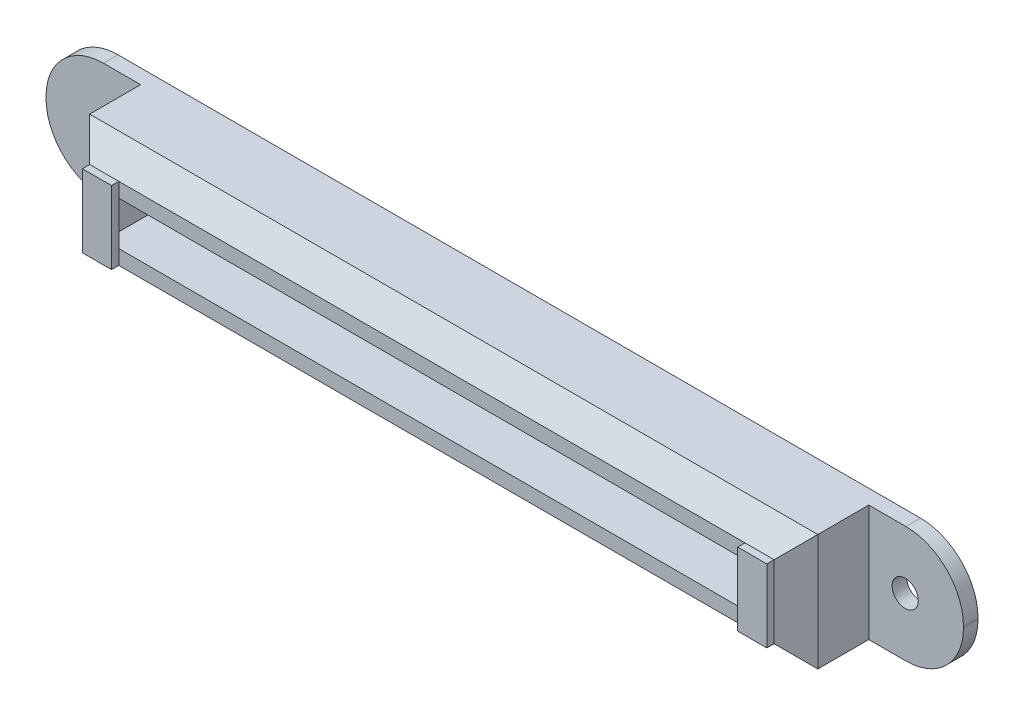
ISO-10303-21;
HEADER;
FILE_DESCRIPTION(('STEP AP214'),'2;1');
FILE_NAME('part.step','',(''),(''),'','','');
FILE_SCHEMA(('AUTOMOTIVE_DESIGN { 1 0 10303 214 1 1 1 1 }'));
ENDSEC;
DATA;
#1=APPLICATION_CONTEXT('core data for automotive mechanical design processes');
#2=APPLICATION_PROTOCOL_DEFINITION('international standard','automotive_design',2000,#1);
#3=PRODUCT_CONTEXT('',#1,'mechanical');
#4=PRODUCT('Part','Part','',(#3));
#5=PRODUCT_RELATED_PRODUCT_CATEGORY('part','',(#4));
#6=PRODUCT_DEFINITION_FORMATION('','',#4);
#7=PRODUCT_DEFINITION_CONTEXT('part definition',#1,'design');
#8=PRODUCT_DEFINITION('design','',#6,#7);
#9=PRODUCT_DEFINITION_SHAPE('','',#8);
#10=(LENGTH_UNIT() NAMED_UNIT(*) SI_UNIT(.MILLI.,.METRE.));
#11=(NAMED_UNIT(*) PLANE_ANGLE_UNIT() SI_UNIT($,.RADIAN.));
#12=(NAMED_UNIT(*) SI_UNIT($,.STERADIAN.) SOLID_ANGLE_UNIT());
#13=UNCERTAINTY_MEASURE_WITH_UNIT(LENGTH_MEASURE(1.E-05),#10,'distance_accuracy_value','');
#14=(GEOMETRIC_REPRESENTATION_CONTEXT(3) GLOBAL_UNCERTAINTY_ASSIGNED_CONTEXT((#13)) GLOBAL_UNIT_ASSIGNED_CONTEXT((#10,
#11,#12)) REPRESENTATION_CONTEXT('',''));
#15=CARTESIAN_POINT('',(0.,0.,0.));
#16=DIRECTION('',(0.,0.,1.));
#17=DIRECTION('',(1.,0.,0.));
#18=AXIS2_PLACEMENT_3D('',#15,#16,#17);
#19=CARTESIAN_POINT('',(-5.,8.,2.));
#20=DIRECTION('',(0.,0.,1.));
#21=DIRECTION('',(1.,0.,0.));
#22=AXIS2_PLACEMENT_3D('',#19,#20,#21);
#23=CYLINDRICAL_SURFACE('',#22,1.8);
#24=CARTESIAN_POINT('',(-5.,8.,0.));
#25=DIRECTION('',(0.,0.,1.));
#26=DIRECTION('',(1.,0.,0.));
#27=AXIS2_PLACEMENT_3D('',#24,#25,#26);
#28=CIRCLE('',#27,1.8);
#29=CARTESIAN_POINT('',(-3.2,8.,0.));
#30=VERTEX_POINT('',#29);
#31=EDGE_CURVE('E258',#30,#30,#28,.F.);
#32=ORIENTED_EDGE('',*,*,#31,.T.);
#33=EDGE_LOOP('',(#32));
#34=FACE_BOUND('',#33,.T.);
#35=CARTESIAN_POINT('',(-5.,8.,2.));
#36=DIRECTION('',(0.,0.,1.));
#37=DIRECTION('',(1.,0.,0.));
#38=AXIS2_PLACEMENT_3D('',#35,#36,#37);
#39=CIRCLE('',#38,1.8);
#40=CARTESIAN_POINT('',(-3.2,8.,2.));
#41=VERTEX_POINT('',#40);
#42=EDGE_CURVE('E226',#41,#41,#39,.F.);
#43=ORIENTED_EDGE('',*,*,#42,.F.);
#44=EDGE_LOOP('',(#43));
#45=FACE_BOUND('',#44,.T.);
#46=ADVANCED_FACE('F16',(#34,#45),#23,.F.);
#47=CARTESIAN_POINT('',(-13.,0.,0.));
#48=DIRECTION('',(-1.,0.,0.));
#49=DIRECTION('',(0.,0.,1.));
#50=AXIS2_PLACEMENT_3D('',#47,#48,#49);
#51=PLANE('',#50);
#52=DIRECTION('',(0.,1.,0.));
#53=VECTOR('',#52,1.);
#54=CARTESIAN_POINT('',(-13.,0.,2.));
#55=LINE('',#54,#53);
#56=CARTESIAN_POINT('',(-13.,7.9,2.));
#57=VERTEX_POINT('',#56);
#58=CARTESIAN_POINT('',(-13.,8.1,2.));
#59=VERTEX_POINT('',#58);
#60=EDGE_CURVE('E223',#57,#59,#55,.T.);
#61=ORIENTED_EDGE('',*,*,#60,.T.);
#62=DIRECTION('',(0.,0.,1.));
#63=VECTOR('',#62,1.);
#64=CARTESIAN_POINT('',(-13.,8.1,0.));
#65=LINE('',#64,#63);
#66=CARTESIAN_POINT('',(-13.,8.1,0.));
#67=VERTEX_POINT('',#66);
#68=EDGE_CURVE('E205',#67,#59,#65,.T.);
#69=ORIENTED_EDGE('',*,*,#68,.F.);
#70=DIRECTION('',(0.,1.,0.));
#71=VECTOR('',#70,1.);
#72=CARTESIAN_POINT('',(-13.,0.,0.));
#73=LINE('',#72,#71);
#74=CARTESIAN_POINT('',(-13.,7.9,0.));
#75=VERTEX_POINT('',#74);
#76=EDGE_CURVE('E227',#67,#75,#73,.F.);
#77=ORIENTED_EDGE('',*,*,#76,.T.);
#78=DIRECTION('',(0.,0.,1.));
#79=VECTOR('',#78,1.);
#80=CARTESIAN_POINT('',(-13.,7.9,0.));
#81=LINE('',#80,#79);
#82=EDGE_CURVE('E382',#57,#75,#81,.F.);
#83=ORIENTED_EDGE('',*,*,#82,.F.);
#84=EDGE_LOOP('',(#61,#69,#77,#83));
#85=FACE_BOUND('',#84,.T.);
#86=ADVANCED_FACE('F545',(#85),#51,.T.);
#87=CARTESIAN_POINT('',(113.,0.,0.));
#88=DIRECTION('',(-1.,0.,0.));
#89=DIRECTION('',(0.,0.,1.));
#90=AXIS2_PLACEMENT_3D('',#87,#88,#89);
#91=PLANE('',#90);
#92=DIRECTION('',(0.,1.,0.));
#93=VECTOR('',#92,1.);
#94=CARTESIAN_POINT('',(113.,0.,2.));
#95=LINE('',#94,#93);
#96=CARTESIAN_POINT('',(113.,8.1,2.));
#97=VERTEX_POINT('',#96);
#98=CARTESIAN_POINT('',(113.,7.9,2.));
#99=VERTEX_POINT('',#98);
#100=EDGE_CURVE('E373',#97,#99,#95,.F.);
#101=ORIENTED_EDGE('',*,*,#100,.T.);
#102=DIRECTION('',(0.,0.,1.));
#103=VECTOR('',#102,1.);
#104=CARTESIAN_POINT('',(113.,7.9,0.));
#105=LINE('',#104,#103);
#106=CARTESIAN_POINT('',(113.,7.9,0.));
#107=VERTEX_POINT('',#106);
#108=EDGE_CURVE('E250',#107,#99,#105,.T.);
#109=ORIENTED_EDGE('',*,*,#108,.F.);
#110=DIRECTION('',(0.,1.,0.));
#111=VECTOR('',#110,1.);
#112=CARTESIAN_POINT('',(113.,0.,0.));
#113=LINE('',#112,#111);
#114=CARTESIAN_POINT('',(113.,8.1,0.));
#115=VERTEX_POINT('',#114);
#116=EDGE_CURVE('E221',#115,#107,#113,.F.);
#117=ORIENTED_EDGE('',*,*,#116,.F.);
#118=DIRECTION('',(0.,0.,1.));
#119=VECTOR('',#118,1.);
#120=CARTESIAN_POINT('',(113.,8.1,0.));
#121=LINE('',#120,#119);
#122=EDGE_CURVE('E254',#97,#115,#121,.F.);
#123=ORIENTED_EDGE('',*,*,#122,.F.);
#124=EDGE_LOOP('',(#101,#109,#117,#123));
#125=FACE_BOUND('',#124,.T.);
#126=ADVANCED_FACE('F540',(#125),#91,.F.);
#127=CARTESIAN_POINT('',(105.,8.,2.));
#128=DIRECTION('',(0.,0.,1.));
#129=DIRECTION('',(1.,0.,0.));
#130=AXIS2_PLACEMENT_3D('',#127,#128,#129);
#131=CYLINDRICAL_SURFACE('',#130,1.8);
#132=CARTESIAN_POINT('',(105.,8.,2.));
#133=DIRECTION('',(0.,0.,1.));
#134=DIRECTION('',(1.,0.,0.));
#135=AXIS2_PLACEMENT_3D('',#132,#133,#134);
#136=CIRCLE('',#135,1.8);
#137=CARTESIAN_POINT('',(106.8,8.,2.));
#138=VERTEX_POINT('',#137);
#139=EDGE_CURVE('E261',#138,#138,#136,.F.);
#140=ORIENTED_EDGE('',*,*,#139,.F.);
#141=EDGE_LOOP('',(#140));
#142=FACE_BOUND('',#141,.T.);
#143=CARTESIAN_POINT('',(105.,8.,0.));
#144=DIRECTION('',(0.,0.,1.));
#145=DIRECTION('',(1.,0.,0.));
#146=AXIS2_PLACEMENT_3D('',#143,#144,#145);
#147=CIRCLE('',#146,1.8);
#148=CARTESIAN_POINT('',(106.8,8.,0.));
#149=VERTEX_POINT('',#148);
#150=EDGE_CURVE('E243',#149,#149,#147,.T.);
#151=ORIENTED_EDGE('',*,*,#150,.F.);
#152=EDGE_LOOP('',(#151));
#153=FACE_BOUND('',#152,.T.);
#154=ADVANCED_FACE('F558',(#142,#153),#131,.F.);
#155=CARTESIAN_POINT('',(-5.1,8.1,0.));
#156=DIRECTION('',(0.,0.,1.));
#157=DIRECTION('',(1.,0.,0.));
#158=AXIS2_PLACEMENT_3D('',#155,#156,#157);
#159=CYLINDRICAL_SURFACE('',#158,7.9);
#160=DIRECTION('',(0.,0.,1.));
#161=VECTOR('',#160,1.);
#162=CARTESIAN_POINT('',(-5.1,16.,0.));
#163=LINE('',#162,#161);
#164=CARTESIAN_POINT('',(-5.1,16.,0.));
#165=VERTEX_POINT('',#164);
#166=CARTESIAN_POINT('',(-5.1,16.,2.));
#167=VERTEX_POINT('',#166);
#168=EDGE_CURVE('E185',#165,#167,#163,.T.);
#169=ORIENTED_EDGE('',*,*,#168,.F.);
#170=CARTESIAN_POINT('',(-5.1,8.1,0.));
#171=DIRECTION('',(0.,0.,1.));
#172=DIRECTION('',(1.,0.,0.));
#173=AXIS2_PLACEMENT_3D('',#170,#171,#172);
#174=CIRCLE('',#173,7.9);
#175=EDGE_CURVE('E240',#165,#67,#174,.T.);
#176=ORIENTED_EDGE('',*,*,#175,.T.);
#177=ORIENTED_EDGE('',*,*,#68,.T.);
#178=CARTESIAN_POINT('',(-5.1,8.1,2.));
#179=DIRECTION('',(0.,0.,1.));
#180=DIRECTION('',(1.,0.,0.));
#181=AXIS2_PLACEMENT_3D('',#178,#179,#180);
#182=CIRCLE('',#181,7.9);
#183=EDGE_CURVE('E202',#167,#59,#182,.T.);
#184=ORIENTED_EDGE('',*,*,#183,.F.);
#185=EDGE_LOOP('',(#169,#176,#177,#184));
#186=FACE_BOUND('',#185,.T.);
#187=ADVANCED_FACE('F203',(#186),#159,.T.);
#188=CARTESIAN_POINT('',(-5.1,7.9,0.));
#189=DIRECTION('',(0.,0.,1.));
#190=DIRECTION('',(1.,0.,0.));
#191=AXIS2_PLACEMENT_3D('',#188,#189,#190);
#192=CYLINDRICAL_SURFACE('',#191,7.9);
#193=ORIENTED_EDGE('',*,*,#82,.T.);
#194=CARTESIAN_POINT('',(-5.1,7.9,0.));
#195=DIRECTION('',(0.,0.,1.));
#196=DIRECTION('',(1.,0.,0.));
#197=AXIS2_PLACEMENT_3D('',#194,#195,#196);
#198=CIRCLE('',#197,7.9);
#199=CARTESIAN_POINT('',(-5.1,0.,0.));
#200=VERTEX_POINT('',#199);
#201=EDGE_CURVE('E236',#75,#200,#198,.T.);
#202=ORIENTED_EDGE('',*,*,#201,.T.);
#203=DIRECTION('',(0.,0.,1.));
#204=VECTOR('',#203,1.);
#205=CARTESIAN_POINT('',(-5.1,0.,0.));
#206=LINE('',#205,#204);
#207=CARTESIAN_POINT('',(-5.1,0.,2.));
#208=VERTEX_POINT('',#207);
#209=EDGE_CURVE('E385',#200,#208,#206,.T.);
#210=ORIENTED_EDGE('',*,*,#209,.T.);
#211=CARTESIAN_POINT('',(-5.1,7.9,2.));
#212=DIRECTION('',(0.,0.,1.));
#213=DIRECTION('',(1.,0.,0.));
#214=AXIS2_PLACEMENT_3D('',#211,#212,#213);
#215=CIRCLE('',#214,7.9);
#216=EDGE_CURVE('E198',#57,#208,#215,.T.);
#217=ORIENTED_EDGE('',*,*,#216,.F.);
#218=EDGE_LOOP('',(#193,#202,#210,#217));
#219=FACE_BOUND('',#218,.T.);
#220=ADVANCED_FACE('F549',(#219),#192,.T.);
#221=CARTESIAN_POINT('',(98.,0.,2.));
#222=DIRECTION('',(0.,0.,-1.));
#223=DIRECTION('',(-1.,0.,0.));
#224=AXIS2_PLACEMENT_3D('',#221,#222,#223);
#225=PLANE('',#224);
#226=ORIENTED_EDGE('',*,*,#100,.F.);
#227=CARTESIAN_POINT('',(105.1,8.1,2.));
#228=DIRECTION('',(0.,0.,1.));
#229=DIRECTION('',(1.,0.,0.));
#230=AXIS2_PLACEMENT_3D('',#227,#228,#229);
#231=CIRCLE('',#230,7.9);
#232=CARTESIAN_POINT('',(105.1,16.,2.));
#233=VERTEX_POINT('',#232);
#234=EDGE_CURVE('E251',#233,#97,#231,.F.);
#235=ORIENTED_EDGE('',*,*,#234,.F.);
#236=DIRECTION('',(1.,0.,0.));
#237=VECTOR('',#236,1.);
#238=CARTESIAN_POINT('',(113.,16.,2.));
#239=LINE('',#238,#237);
#240=CARTESIAN_POINT('',(100.,16.,2.));
#241=VERTEX_POINT('',#240);
#242=EDGE_CURVE('E217',#233,#241,#239,.F.);
#243=ORIENTED_EDGE('',*,*,#242,.T.);
#244=DIRECTION('',(0.,1.,0.));
#245=VECTOR('',#244,1.);
#246=CARTESIAN_POINT('',(100.,0.,2.));
#247=LINE('',#246,#245);
#248=CARTESIAN_POINT('',(100.,0.,2.));
#249=VERTEX_POINT('',#248);
#250=EDGE_CURVE('E239',#241,#249,#247,.F.);
#251=ORIENTED_EDGE('',*,*,#250,.T.);
#252=DIRECTION('',(1.,0.,0.));
#253=VECTOR('',#252,1.);
#254=CARTESIAN_POINT('',(98.,0.,2.));
#255=LINE('',#254,#253);
#256=CARTESIAN_POINT('',(105.1,0.,2.));
#257=VERTEX_POINT('',#256);
#258=EDGE_CURVE('E214',#249,#257,#255,.T.);
#259=ORIENTED_EDGE('',*,*,#258,.T.);
#260=CARTESIAN_POINT('',(105.1,7.9,2.));
#261=DIRECTION('',(0.,0.,1.));
#262=DIRECTION('',(1.,0.,0.));
#263=AXIS2_PLACEMENT_3D('',#260,#261,#262);
#264=CIRCLE('',#263,7.9);
#265=EDGE_CURVE('E248',#99,#257,#264,.F.);
#266=ORIENTED_EDGE('',*,*,#265,.F.);
#267=EDGE_LOOP('',(#226,#235,#243,#251,#259,#266));
#268=FACE_BOUND('',#267,.T.);
#269=ORIENTED_EDGE('',*,*,#139,.T.);
#270=EDGE_LOOP('',(#269));
#271=FACE_BOUND('',#270,.T.);
#272=ADVANCED_FACE('F535',(#268,#271),#225,.F.);
#273=CARTESIAN_POINT('',(2.,0.,2.));
#274=DIRECTION('',(0.,0.,1.));
#275=DIRECTION('',(1.,0.,0.));
#276=AXIS2_PLACEMENT_3D('',#273,#274,#275);
#277=PLANE('',#276);
#278=ORIENTED_EDGE('',*,*,#60,.F.);
#279=ORIENTED_EDGE('',*,*,#216,.T.);
#280=DIRECTION('',(1.,0.,0.));
#281=VECTOR('',#280,1.);
#282=CARTESIAN_POINT('',(2.,0.,2.));
#283=LINE('',#282,#281);
#284=CARTESIAN_POINT('',(0.,0.,2.));
#285=VERTEX_POINT('',#284);
#286=EDGE_CURVE('E207',#208,#285,#283,.T.);
#287=ORIENTED_EDGE('',*,*,#286,.T.);
#288=DIRECTION('',(0.,1.,0.));
#289=VECTOR('',#288,1.);
#290=CARTESIAN_POINT('',(0.,16.,2.));
#291=LINE('',#290,#289);
#292=CARTESIAN_POINT('',(0.,16.,2.));
#293=VERTEX_POINT('',#292);
#294=EDGE_CURVE('E212',#285,#293,#291,.T.);
#295=ORIENTED_EDGE('',*,*,#294,.T.);
#296=DIRECTION('',(1.,0.,0.));
#297=VECTOR('',#296,1.);
#298=CARTESIAN_POINT('',(-13.,16.,2.));
#299=LINE('',#298,#297);
#300=EDGE_CURVE('E191',#167,#293,#299,.T.);
#301=ORIENTED_EDGE('',*,*,#300,.F.);
#302=ORIENTED_EDGE('',*,*,#183,.T.);
#303=EDGE_LOOP('',(#278,#279,#287,#295,#301,#302));
#304=FACE_BOUND('',#303,.T.);
#305=ORIENTED_EDGE('',*,*,#42,.T.);
#306=EDGE_LOOP('',(#305));
#307=FACE_BOUND('',#306,.T.);
#308=ADVANCED_FACE('F209',(#304,#307),#277,.T.);
#309=CARTESIAN_POINT('',(105.1,8.1,0.));
#310=DIRECTION('',(0.,0.,1.));
#311=DIRECTION('',(1.,0.,0.));
#312=AXIS2_PLACEMENT_3D('',#309,#310,#311);
#313=CYLINDRICAL_SURFACE('',#312,7.9);
#314=ORIENTED_EDGE('',*,*,#234,.T.);
#315=ORIENTED_EDGE('',*,*,#122,.T.);
#316=CARTESIAN_POINT('',(105.1,8.1,0.));
#317=DIRECTION('',(0.,0.,1.));
#318=DIRECTION('',(1.,0.,0.));
#319=AXIS2_PLACEMENT_3D('',#316,#317,#318);
#320=CIRCLE('',#319,7.9);
#321=CARTESIAN_POINT('',(105.1,16.,0.));
#322=VERTEX_POINT('',#321);
#323=EDGE_CURVE('E233',#322,#115,#320,.F.);
#324=ORIENTED_EDGE('',*,*,#323,.F.);
#325=DIRECTION('',(0.,0.,1.));
#326=VECTOR('',#325,1.);
#327=CARTESIAN_POINT('',(105.1,16.,0.));
#328=LINE('',#327,#326);
#329=EDGE_CURVE('E255',#322,#233,#328,.T.);
#330=ORIENTED_EDGE('',*,*,#329,.T.);
#331=EDGE_LOOP('',(#314,#315,#324,#330));
#332=FACE_BOUND('',#331,.T.);
#333=ADVANCED_FACE('F533',(#332),#313,.T.);
#334=CARTESIAN_POINT('',(105.1,7.9,0.));
#335=DIRECTION('',(0.,0.,1.));
#336=DIRECTION('',(1.,0.,0.));
#337=AXIS2_PLACEMENT_3D('',#334,#335,#336);
#338=CYLINDRICAL_SURFACE('',#337,7.9);
#339=ORIENTED_EDGE('',*,*,#265,.T.);
#340=DIRECTION('',(0.,0.,1.));
#341=VECTOR('',#340,1.);
#342=CARTESIAN_POINT('',(105.1,0.,0.));
#343=LINE('',#342,#341);
#344=CARTESIAN_POINT('',(105.1,0.,0.));
#345=VERTEX_POINT('',#344);
#346=EDGE_CURVE('E247',#257,#345,#343,.F.);
#347=ORIENTED_EDGE('',*,*,#346,.T.);
#348=CARTESIAN_POINT('',(105.1,7.9,0.));
#349=DIRECTION('',(0.,0.,1.));
#350=DIRECTION('',(1.,0.,0.));
#351=AXIS2_PLACEMENT_3D('',#348,#349,#350);
#352=CIRCLE('',#351,7.9);
#353=EDGE_CURVE('E229',#107,#345,#352,.F.);
#354=ORIENTED_EDGE('',*,*,#353,.F.);
#355=ORIENTED_EDGE('',*,*,#108,.T.);
#356=EDGE_LOOP('',(#339,#347,#354,#355));
#357=FACE_BOUND('',#356,.T.);
#358=ADVANCED_FACE('F620',(#357),#338,.T.);
#359=CARTESIAN_POINT('',(97.,13.,12.));
#360=DIRECTION('',(0.,-1.,0.));
#361=DIRECTION('',(0.,0.,-1.));
#362=AXIS2_PLACEMENT_3D('',#359,#360,#361);
#363=PLANE('',#362);
#364=DIRECTION('',(0.,0.,-1.));
#365=VECTOR('',#364,1.);
#366=CARTESIAN_POINT('',(93.,13.,12.));
#367=LINE('',#366,#365);
#368=CARTESIAN_POINT('',(93.,13.,13.));
#369=VERTEX_POINT('',#368);
#370=CARTESIAN_POINT('',(93.,13.,12.));
#371=VERTEX_POINT('',#370);
#372=EDGE_CURVE('E246',#369,#371,#367,.T.);
#373=ORIENTED_EDGE('',*,*,#372,.F.);
#374=DIRECTION('',(-1.,0.,0.));
#375=VECTOR('',#374,1.);
#376=CARTESIAN_POINT('',(93.,13.,13.));
#377=LINE('',#376,#375);
#378=CARTESIAN_POINT('',(97.,13.,13.));
#379=VERTEX_POINT('',#378);
#380=EDGE_CURVE('E232',#369,#379,#377,.F.);
#381=ORIENTED_EDGE('',*,*,#380,.T.);
#382=DIRECTION('',(0.,0.,1.));
#383=VECTOR('',#382,1.);
#384=CARTESIAN_POINT('',(97.,13.,12.));
#385=LINE('',#384,#383);
#386=CARTESIAN_POINT('',(97.,13.,12.));
#387=VERTEX_POINT('',#386);
#388=EDGE_CURVE('E326',#379,#387,#385,.F.);
#389=ORIENTED_EDGE('',*,*,#388,.T.);
#390=DIRECTION('',(1.,0.,0.));
#391=VECTOR('',#390,1.);
#392=CARTESIAN_POINT('',(100.,13.,12.));
#393=LINE('',#392,#391);
#394=EDGE_CURVE('E334',#371,#387,#393,.T.);
#395=ORIENTED_EDGE('',*,*,#394,.F.);
#396=EDGE_LOOP('',(#373,#381,#389,#395));
#397=FACE_BOUND('',#396,.T.);
#398=ADVANCED_FACE('F526',(#397),#363,.F.);
#399=CARTESIAN_POINT('',(97.,3.,12.));
#400=DIRECTION('',(-1.,0.,0.));
#401=DIRECTION('',(0.,0.,1.));
#402=AXIS2_PLACEMENT_3D('',#399,#400,#401);
#403=PLANE('',#402);
#404=ORIENTED_EDGE('',*,*,#388,.F.);
#405=DIRECTION('',(0.,1.,0.));
#406=VECTOR('',#405,1.);
#407=CARTESIAN_POINT('',(97.,3.,13.));
#408=LINE('',#407,#406);
#409=CARTESIAN_POINT('',(97.,3.,13.));
#410=VERTEX_POINT('',#409);
#411=EDGE_CURVE('E353',#379,#410,#408,.F.);
#412=ORIENTED_EDGE('',*,*,#411,.T.);
#413=DIRECTION('',(0.,0.,1.));
#414=VECTOR('',#413,1.);
#415=CARTESIAN_POINT('',(97.,3.,12.));
#416=LINE('',#415,#414);
#417=CARTESIAN_POINT('',(97.,3.,12.));
#418=VERTEX_POINT('',#417);
#419=EDGE_CURVE('E324',#418,#410,#416,.T.);
#420=ORIENTED_EDGE('',*,*,#419,.F.);
#421=DIRECTION('',(0.,1.,0.));
#422=VECTOR('',#421,1.);
#423=CARTESIAN_POINT('',(97.,0.,12.));
#424=LINE('',#423,#422);
#425=EDGE_CURVE('E316',#387,#418,#424,.F.);
#426=ORIENTED_EDGE('',*,*,#425,.F.);
#427=EDGE_LOOP('',(#404,#412,#420,#426));
#428=FACE_BOUND('',#427,.T.);
#429=ADVANCED_FACE('F524',(#428),#403,.F.);
#430=CARTESIAN_POINT('',(3.,13.,12.));
#431=DIRECTION('',(1.,0.,0.));
#432=DIRECTION('',(0.,0.,-1.));
#433=AXIS2_PLACEMENT_3D('',#430,#431,#432);
#434=PLANE('',#433);
#435=DIRECTION('',(0.,0.,1.));
#436=VECTOR('',#435,1.);
#437=CARTESIAN_POINT('',(3.,3.,12.));
#438=LINE('',#437,#436);
#439=CARTESIAN_POINT('',(3.,3.,12.));
#440=VERTEX_POINT('',#439);
#441=CARTESIAN_POINT('',(3.,3.,13.));
#442=VERTEX_POINT('',#441);
#443=EDGE_CURVE('E310',#440,#442,#438,.T.);
#444=ORIENTED_EDGE('',*,*,#443,.T.);
#445=DIRECTION('',(0.,1.,0.));
#446=VECTOR('',#445,1.);
#447=CARTESIAN_POINT('',(3.,3.,13.));
#448=LINE('',#447,#446);
#449=CARTESIAN_POINT('',(3.,13.,13.));
#450=VERTEX_POINT('',#449);
#451=EDGE_CURVE('E309',#442,#450,#448,.T.);
#452=ORIENTED_EDGE('',*,*,#451,.T.);
#453=DIRECTION('',(0.,0.,-1.));
#454=VECTOR('',#453,1.);
#455=CARTESIAN_POINT('',(3.,13.,12.));
#456=LINE('',#455,#454);
#457=CARTESIAN_POINT('',(2.99999999999999,13.,12.));
#458=VERTEX_POINT('',#457);
#459=EDGE_CURVE('E242',#450,#458,#456,.T.);
#460=ORIENTED_EDGE('',*,*,#459,.T.);
#461=DIRECTION('',(0.,1.,0.));
#462=VECTOR('',#461,1.);
#463=CARTESIAN_POINT('',(3.,16.,12.));
#464=LINE('',#463,#462);
#465=EDGE_CURVE('E331',#440,#458,#464,.T.);
#466=ORIENTED_EDGE('',*,*,#465,.F.);
#467=EDGE_LOOP('',(#444,#452,#460,#466));
#468=FACE_BOUND('',#467,.T.);
#469=ADVANCED_FACE('F612',(#468),#434,.F.);
#470=CARTESIAN_POINT('',(7.,13.,12.));
#471=DIRECTION('',(0.,-1.,0.));
#472=DIRECTION('',(0.,0.,-1.));
#473=AXIS2_PLACEMENT_3D('',#470,#471,#472);
#474=PLANE('',#473);
#475=ORIENTED_EDGE('',*,*,#459,.F.);
#476=DIRECTION('',(-1.,0.,0.));
#477=VECTOR('',#476,1.);
#478=CARTESIAN_POINT('',(3.,13.,13.));
#479=LINE('',#478,#477);
#480=CARTESIAN_POINT('',(7.,13.,13.));
#481=VERTEX_POINT('',#480);
#482=EDGE_CURVE('E306',#450,#481,#479,.F.);
#483=ORIENTED_EDGE('',*,*,#482,.T.);
#484=DIRECTION('',(0.,0.,-1.));
#485=VECTOR('',#484,1.);
#486=CARTESIAN_POINT('',(7.,13.,12.));
#487=LINE('',#486,#485);
#488=CARTESIAN_POINT('',(6.99999999999999,13.,12.));
#489=VERTEX_POINT('',#488);
#490=EDGE_CURVE('E338',#489,#481,#487,.F.);
#491=ORIENTED_EDGE('',*,*,#490,.F.);
#492=DIRECTION('',(1.,0.,0.));
#493=VECTOR('',#492,1.);
#494=CARTESIAN_POINT('',(100.,13.,12.));
#495=LINE('',#494,#493);
#496=EDGE_CURVE('E323',#458,#489,#495,.T.);
#497=ORIENTED_EDGE('',*,*,#496,.F.);
#498=EDGE_LOOP('',(#475,#483,#491,#497));
#499=FACE_BOUND('',#498,.T.);
#500=ADVANCED_FACE('F495',(#499),#474,.F.);
#501=CARTESIAN_POINT('',(100.,0.,0.));
#502=DIRECTION('',(-1.,0.,0.));
#503=DIRECTION('',(0.,0.,1.));
#504=AXIS2_PLACEMENT_3D('',#501,#502,#503);
#505=PLANE('',#504);
#506=DIRECTION('',(0.,0.,1.));
#507=VECTOR('',#506,1.);
#508=CARTESIAN_POINT('',(100.,0.,0.));
#509=LINE('',#508,#507);
#510=CARTESIAN_POINT('',(100.,0.,9.));
#511=VERTEX_POINT('',#510);
#512=EDGE_CURVE('E320',#511,#249,#509,.F.);
#513=ORIENTED_EDGE('',*,*,#512,.T.);
#514=ORIENTED_EDGE('',*,*,#250,.F.);
#515=DIRECTION('',(0.,0.,-1.));
#516=VECTOR('',#515,1.);
#517=CARTESIAN_POINT('',(100.,16.,0.));
#518=LINE('',#517,#516);
#519=CARTESIAN_POINT('',(100.,16.,9.));
#520=VERTEX_POINT('',#519);
#521=EDGE_CURVE('E301',#241,#520,#518,.F.);
#522=ORIENTED_EDGE('',*,*,#521,.T.);
#523=DIRECTION('',(0.,1.,0.));
#524=VECTOR('',#523,1.);
#525=CARTESIAN_POINT('',(100.,0.,9.));
#526=LINE('',#525,#524);
#527=EDGE_CURVE('E327',#511,#520,#526,.T.);
#528=ORIENTED_EDGE('',*,*,#527,.F.);
#529=EDGE_LOOP('',(#513,#514,#522,#528));
#530=FACE_BOUND('',#529,.T.);
#531=ADVANCED_FACE('F518',(#530),#505,.F.);
#532=CARTESIAN_POINT('',(100.,14.5,10.5));
#533=DIRECTION('',(0.,0.707106781186548,0.707106781186548));
#534=DIRECTION('',(0.,-0.707106781186548,0.707106781186548));
#535=AXIS2_PLACEMENT_3D('',#532,#533,#534);
#536=PLANE('',#535);
#537=DIRECTION('',(-0.577350269189626,-0.577350269189625,0.577350269189626));
#538=VECTOR('',#537,1.);
#539=CARTESIAN_POINT('',(100.,16.,9.));
#540=LINE('',#539,#538);
#541=EDGE_CURVE('E330',#520,#387,#540,.T.);
#542=ORIENTED_EDGE('',*,*,#541,.F.);
#543=DIRECTION('',(1.,0.,0.));
#544=VECTOR('',#543,1.);
#545=CARTESIAN_POINT('',(100.,16.,9.000000000001));
#546=LINE('',#545,#544);
#547=CARTESIAN_POINT('',(0.,16.,9.0000000000005));
#548=VERTEX_POINT('',#547);
#549=EDGE_CURVE('E297',#520,#548,#546,.F.);
#550=ORIENTED_EDGE('',*,*,#549,.T.);
#551=DIRECTION('',(-0.577350269189626,0.577350269189626,-0.577350269189626));
#552=VECTOR('',#551,1.);
#553=CARTESIAN_POINT('',(3.,13.,12.));
#554=LINE('',#553,#552);
#555=EDGE_CURVE('E350',#458,#548,#554,.T.);
#556=ORIENTED_EDGE('',*,*,#555,.F.);
#557=ORIENTED_EDGE('',*,*,#496,.T.);
#558=DIRECTION('',(-1.,0.,0.));
#559=VECTOR('',#558,1.);
#560=CARTESIAN_POINT('',(0.,13.,12.));
#561=LINE('',#560,#559);
#562=EDGE_CURVE('E305',#489,#371,#561,.F.);
#563=ORIENTED_EDGE('',*,*,#562,.T.);
#564=ORIENTED_EDGE('',*,*,#394,.T.);
#565=EDGE_LOOP('',(#542,#550,#556,#557,#563,#564));
#566=FACE_BOUND('',#565,.T.);
#567=ADVANCED_FACE('F528',(#566),#536,.T.);
#568=CARTESIAN_POINT('',(0.,16.,0.));
#569=DIRECTION('',(1.,0.,0.));
#570=DIRECTION('',(0.,0.,-1.));
#571=AXIS2_PLACEMENT_3D('',#568,#569,#570);
#572=PLANE('',#571);
#573=DIRECTION('',(0.,1.,0.));
#574=VECTOR('',#573,1.);
#575=CARTESIAN_POINT('',(0.,16.,9.));
#576=LINE('',#575,#574);
#577=CARTESIAN_POINT('',(0.,0.,9.));
#578=VERTEX_POINT('',#577);
#579=EDGE_CURVE('E352',#548,#578,#576,.F.);
#580=ORIENTED_EDGE('',*,*,#579,.F.);
#581=DIRECTION('',(0.,0.,-1.));
#582=VECTOR('',#581,1.);
#583=CARTESIAN_POINT('',(0.,16.,0.));
#584=LINE('',#583,#582);
#585=EDGE_CURVE('E300',#548,#293,#584,.T.);
#586=ORIENTED_EDGE('',*,*,#585,.T.);
#587=ORIENTED_EDGE('',*,*,#294,.F.);
#588=DIRECTION('',(0.,0.,1.));
#589=VECTOR('',#588,1.);
#590=CARTESIAN_POINT('',(0.,0.,0.));
#591=LINE('',#590,#589);
#592=EDGE_CURVE('E343',#285,#578,#591,.T.);
#593=ORIENTED_EDGE('',*,*,#592,.T.);
#594=EDGE_LOOP('',(#580,#586,#587,#593));
#595=FACE_BOUND('',#594,.T.);
#596=ADVANCED_FACE('F509',(#595),#572,.F.);
#597=CARTESIAN_POINT('',(93.,3.,13.));
#598=DIRECTION('',(0.,0.,-1.));
#599=DIRECTION('',(-1.,0.,0.));
#600=AXIS2_PLACEMENT_3D('',#597,#598,#599);
#601=PLANE('',#600);
#602=ORIENTED_EDGE('',*,*,#411,.F.);
#603=ORIENTED_EDGE('',*,*,#380,.F.);
#604=DIRECTION('',(0.,1.,0.));
#605=VECTOR('',#604,1.);
#606=CARTESIAN_POINT('',(93.,13.,13.));
#607=LINE('',#606,#605);
#608=CARTESIAN_POINT('',(93.,3.,13.));
#609=VERTEX_POINT('',#608);
#610=EDGE_CURVE('E296',#369,#609,#607,.F.);
#611=ORIENTED_EDGE('',*,*,#610,.T.);
#612=DIRECTION('',(1.,0.,0.));
#613=VECTOR('',#612,1.);
#614=CARTESIAN_POINT('',(93.,3.,13.));
#615=LINE('',#614,#613);
#616=EDGE_CURVE('E313',#609,#410,#615,.T.);
#617=ORIENTED_EDGE('',*,*,#616,.T.);
#618=EDGE_LOOP('',(#602,#603,#611,#617));
#619=FACE_BOUND('',#618,.T.);
#620=ADVANCED_FACE('F403',(#619),#601,.F.);
#621=CARTESIAN_POINT('',(1.5,16.,10.5));
#622=DIRECTION('',(-0.707106781186548,0.,0.707106781186548));
#623=DIRECTION('',(0.707106781186548,0.,0.707106781186548));
#624=AXIS2_PLACEMENT_3D('',#621,#622,#623);
#625=PLANE('',#624);
#626=DIRECTION('',(-0.577350269189626,-0.577350269189626,-0.577350269189626));
#627=VECTOR('',#626,1.);
#628=CARTESIAN_POINT('',(3.,3.,12.));
#629=LINE('',#628,#627);
#630=EDGE_CURVE('E347',#440,#578,#629,.T.);
#631=ORIENTED_EDGE('',*,*,#630,.F.);
#632=ORIENTED_EDGE('',*,*,#465,.T.);
#633=ORIENTED_EDGE('',*,*,#555,.T.);
#634=ORIENTED_EDGE('',*,*,#579,.T.);
#635=EDGE_LOOP('',(#631,#632,#633,#634));
#636=FACE_BOUND('',#635,.T.);
#637=ADVANCED_FACE('F505',(#636),#625,.T.);
#638=CARTESIAN_POINT('',(98.5,0.,10.5));
#639=DIRECTION('',(0.707106781186548,0.,0.707106781186548));
#640=DIRECTION('',(0.707106781186548,0.,-0.707106781186548));
#641=AXIS2_PLACEMENT_3D('',#638,#639,#640);
#642=PLANE('',#641);
#643=ORIENTED_EDGE('',*,*,#541,.T.);
#644=ORIENTED_EDGE('',*,*,#425,.T.);
#645=DIRECTION('',(-0.577350269189626,0.577350269189626,0.577350269189626));
#646=VECTOR('',#645,1.);
#647=CARTESIAN_POINT('',(100.,0.,9.));
#648=LINE('',#647,#646);
#649=EDGE_CURVE('E291',#511,#418,#648,.T.);
#650=ORIENTED_EDGE('',*,*,#649,.F.);
#651=ORIENTED_EDGE('',*,*,#527,.T.);
#652=EDGE_LOOP('',(#643,#644,#650,#651));
#653=FACE_BOUND('',#652,.T.);
#654=ADVANCED_FACE('F521',(#653),#642,.T.);
#655=CARTESIAN_POINT('',(93.,3.,12.));
#656=DIRECTION('',(0.,1.,0.));
#657=DIRECTION('',(0.,0.,1.));
#658=AXIS2_PLACEMENT_3D('',#655,#656,#657);
#659=PLANE('',#658);
#660=ORIENTED_EDGE('',*,*,#419,.T.);
#661=ORIENTED_EDGE('',*,*,#616,.F.);
#662=DIRECTION('',(0.,0.,-1.));
#663=VECTOR('',#662,1.);
#664=CARTESIAN_POINT('',(93.,3.,12.));
#665=LINE('',#664,#663);
#666=CARTESIAN_POINT('',(93.,3.,12.));
#667=VERTEX_POINT('',#666);
#668=EDGE_CURVE('E292',#609,#667,#665,.T.);
#669=ORIENTED_EDGE('',*,*,#668,.T.);
#670=DIRECTION('',(1.,0.,0.));
#671=VECTOR('',#670,1.);
#672=CARTESIAN_POINT('',(0.,3.,12.));
#673=LINE('',#672,#671);
#674=EDGE_CURVE('E289',#418,#667,#673,.F.);
#675=ORIENTED_EDGE('',*,*,#674,.F.);
#676=EDGE_LOOP('',(#660,#661,#669,#675));
#677=FACE_BOUND('',#676,.T.);
#678=ADVANCED_FACE('F414',(#677),#659,.F.);
#679=CARTESIAN_POINT('',(3.,3.,12.));
#680=DIRECTION('',(0.,1.,0.));
#681=DIRECTION('',(0.,0.,1.));
#682=AXIS2_PLACEMENT_3D('',#679,#680,#681);
#683=PLANE('',#682);
#684=DIRECTION('',(0.,0.,1.));
#685=VECTOR('',#684,1.);
#686=CARTESIAN_POINT('',(7.,3.,12.));
#687=LINE('',#686,#685);
#688=CARTESIAN_POINT('',(7.,3.,13.));
#689=VERTEX_POINT('',#688);
#690=CARTESIAN_POINT('',(7.,3.,12.));
#691=VERTEX_POINT('',#690);
#692=EDGE_CURVE('E307',#689,#691,#687,.F.);
#693=ORIENTED_EDGE('',*,*,#692,.F.);
#694=DIRECTION('',(-1.,0.,0.));
#695=VECTOR('',#694,1.);
#696=CARTESIAN_POINT('',(3.,3.,13.));
#697=LINE('',#696,#695);
#698=EDGE_CURVE('E302',#689,#442,#697,.T.);
#699=ORIENTED_EDGE('',*,*,#698,.T.);
#700=ORIENTED_EDGE('',*,*,#443,.F.);
#701=DIRECTION('',(1.,0.,0.));
#702=VECTOR('',#701,1.);
#703=CARTESIAN_POINT('',(0.,3.,12.));
#704=LINE('',#703,#702);
#705=EDGE_CURVE('E286',#691,#440,#704,.F.);
#706=ORIENTED_EDGE('',*,*,#705,.F.);
#707=EDGE_LOOP('',(#693,#699,#700,#706));
#708=FACE_BOUND('',#707,.T.);
#709=ADVANCED_FACE('F500',(#708),#683,.F.);
#710=CARTESIAN_POINT('',(3.,3.,13.));
#711=DIRECTION('',(0.,0.,-1.));
#712=DIRECTION('',(-1.,0.,0.));
#713=AXIS2_PLACEMENT_3D('',#710,#711,#712);
#714=PLANE('',#713);
#715=DIRECTION('',(0.,1.,0.));
#716=VECTOR('',#715,1.);
#717=CARTESIAN_POINT('',(7.,3.,13.));
#718=LINE('',#717,#716);
#719=EDGE_CURVE('E281',#689,#481,#718,.T.);
#720=ORIENTED_EDGE('',*,*,#719,.T.);
#721=ORIENTED_EDGE('',*,*,#482,.F.);
#722=ORIENTED_EDGE('',*,*,#451,.F.);
#723=ORIENTED_EDGE('',*,*,#698,.F.);
#724=EDGE_LOOP('',(#720,#721,#722,#723));
#725=FACE_BOUND('',#724,.T.);
#726=ADVANCED_FACE('F498',(#725),#714,.F.);
#727=CARTESIAN_POINT('',(0.,0.,12.));
#728=DIRECTION('',(0.,0.,-1.));
#729=DIRECTION('',(-1.,0.,0.));
#730=AXIS2_PLACEMENT_3D('',#727,#728,#729);
#731=PLANE('',#730);
#732=DIRECTION('',(1.,0.,0.));
#733=VECTOR('',#732,1.);
#734=CARTESIAN_POINT('',(95.,11.,12.));
#735=LINE('',#734,#733);
#736=CARTESIAN_POINT('',(7.,11.,12.));
#737=VERTEX_POINT('',#736);
#738=CARTESIAN_POINT('',(93.,11.,12.));
#739=VERTEX_POINT('',#738);
#740=EDGE_CURVE('E270',#737,#739,#735,.T.);
#741=ORIENTED_EDGE('',*,*,#740,.T.);
#742=DIRECTION('',(0.,1.,0.));
#743=VECTOR('',#742,1.);
#744=CARTESIAN_POINT('',(93.,13.,12.));
#745=LINE('',#744,#743);
#746=EDGE_CURVE('E295',#739,#371,#745,.T.);
#747=ORIENTED_EDGE('',*,*,#746,.T.);
#748=ORIENTED_EDGE('',*,*,#562,.F.);
#749=DIRECTION('',(0.,1.,0.));
#750=VECTOR('',#749,1.);
#751=CARTESIAN_POINT('',(7.,3.,12.));
#752=LINE('',#751,#750);
#753=EDGE_CURVE('E275',#489,#737,#752,.F.);
#754=ORIENTED_EDGE('',*,*,#753,.T.);
#755=EDGE_LOOP('',(#741,#747,#748,#754));
#756=FACE_BOUND('',#755,.T.);
#757=ADVANCED_FACE('F491',(#756),#731,.F.);
#758=CARTESIAN_POINT('',(0.,0.,0.));
#759=DIRECTION('',(0.,1.,0.));
#760=DIRECTION('',(0.,0.,1.));
#761=AXIS2_PLACEMENT_3D('',#758,#759,#760);
#762=PLANE('',#761);
#763=ORIENTED_EDGE('',*,*,#592,.F.);
#764=ORIENTED_EDGE('',*,*,#286,.F.);
#765=ORIENTED_EDGE('',*,*,#209,.F.);
#766=DIRECTION('',(-1.,0.,0.));
#767=VECTOR('',#766,1.);
#768=CARTESIAN_POINT('',(0.,0.,0.));
#769=LINE('',#768,#767);
#770=EDGE_CURVE('E268',#345,#200,#769,.T.);
#771=ORIENTED_EDGE('',*,*,#770,.F.);
#772=ORIENTED_EDGE('',*,*,#346,.F.);
#773=ORIENTED_EDGE('',*,*,#258,.F.);
#774=ORIENTED_EDGE('',*,*,#512,.F.);
#775=DIRECTION('',(1.,0.,0.));
#776=VECTOR('',#775,1.);
#777=CARTESIAN_POINT('',(0.,0.,9.));
#778=LINE('',#777,#776);
#779=EDGE_CURVE('E344',#578,#511,#778,.T.);
#780=ORIENTED_EDGE('',*,*,#779,.F.);
#781=EDGE_LOOP('',(#763,#764,#765,#771,#772,#773,#774,#780));
#782=FACE_BOUND('',#781,.T.);
#783=ADVANCED_FACE('F514',(#782),#762,.F.);
#784=CARTESIAN_POINT('',(100.,16.,0.));
#785=DIRECTION('',(0.,-1.,0.));
#786=DIRECTION('',(0.,0.,-1.));
#787=AXIS2_PLACEMENT_3D('',#784,#785,#786);
#788=PLANE('',#787);
#789=ORIENTED_EDGE('',*,*,#521,.F.);
#790=ORIENTED_EDGE('',*,*,#242,.F.);
#791=ORIENTED_EDGE('',*,*,#329,.F.);
#792=DIRECTION('',(-1.,0.,0.));
#793=VECTOR('',#792,1.);
#794=CARTESIAN_POINT('',(0.,16.,0.));
#795=LINE('',#794,#793);
#796=EDGE_CURVE('E194',#165,#322,#795,.F.);
#797=ORIENTED_EDGE('',*,*,#796,.F.);
#798=ORIENTED_EDGE('',*,*,#168,.T.);
#799=ORIENTED_EDGE('',*,*,#300,.T.);
#800=ORIENTED_EDGE('',*,*,#585,.F.);
#801=ORIENTED_EDGE('',*,*,#549,.F.);
#802=EDGE_LOOP('',(#789,#790,#791,#797,#798,#799,#800,#801));
#803=FACE_BOUND('',#802,.T.);
#804=ADVANCED_FACE('F188',(#803),#788,.F.);
#805=CARTESIAN_POINT('',(93.,13.,12.));
#806=DIRECTION('',(1.,0.,0.));
#807=DIRECTION('',(0.,0.,-1.));
#808=AXIS2_PLACEMENT_3D('',#805,#806,#807);
#809=PLANE('',#808);
#810=DIRECTION('',(0.,1.,0.));
#811=VECTOR('',#810,1.);
#812=CARTESIAN_POINT('',(93.,3.,12.));
#813=LINE('',#812,#811);
#814=CARTESIAN_POINT('',(93.,5.,12.));
#815=VERTEX_POINT('',#814);
#816=EDGE_CURVE('E434',#815,#739,#813,.T.);
#817=ORIENTED_EDGE('',*,*,#816,.F.);
#818=DIRECTION('',(0.,1.,0.));
#819=VECTOR('',#818,1.);
#820=CARTESIAN_POINT('',(93.,0.,12.));
#821=LINE('',#820,#819);
#822=EDGE_CURVE('E410',#815,#667,#821,.F.);
#823=ORIENTED_EDGE('',*,*,#822,.T.);
#824=ORIENTED_EDGE('',*,*,#668,.F.);
#825=ORIENTED_EDGE('',*,*,#610,.F.);
#826=ORIENTED_EDGE('',*,*,#372,.T.);
#827=ORIENTED_EDGE('',*,*,#746,.F.);
#828=EDGE_LOOP('',(#817,#823,#824,#825,#826,#827));
#829=FACE_BOUND('',#828,.T.);
#830=ADVANCED_FACE('F407',(#829),#809,.F.);
#831=CARTESIAN_POINT('',(0.,1.5,10.5));
#832=DIRECTION('',(0.,-0.707106781186548,0.707106781186548));
#833=DIRECTION('',(0.,-0.707106781186548,-0.707106781186548));
#834=AXIS2_PLACEMENT_3D('',#831,#832,#833);
#835=PLANE('',#834);
#836=DIRECTION('',(-1.,0.,0.));
#837=VECTOR('',#836,1.);
#838=CARTESIAN_POINT('',(0.,3.,12.));
#839=LINE('',#838,#837);
#840=EDGE_CURVE('E418',#667,#691,#839,.T.);
#841=ORIENTED_EDGE('',*,*,#840,.T.);
#842=ORIENTED_EDGE('',*,*,#705,.T.);
#843=ORIENTED_EDGE('',*,*,#630,.T.);
#844=ORIENTED_EDGE('',*,*,#779,.T.);
#845=ORIENTED_EDGE('',*,*,#649,.T.);
#846=ORIENTED_EDGE('',*,*,#674,.T.);
#847=EDGE_LOOP('',(#841,#842,#843,#844,#845,#846));
#848=FACE_BOUND('',#847,.T.);
#849=ADVANCED_FACE('F503',(#848),#835,.T.);
#850=CARTESIAN_POINT('',(7.,3.,12.));
#851=DIRECTION('',(-1.,0.,0.));
#852=DIRECTION('',(0.,0.,1.));
#853=AXIS2_PLACEMENT_3D('',#850,#851,#852);
#854=PLANE('',#853);
#855=DIRECTION('',(0.,1.,0.));
#856=VECTOR('',#855,1.);
#857=CARTESIAN_POINT('',(7.,3.,12.));
#858=LINE('',#857,#856);
#859=CARTESIAN_POINT('',(7.,5.,12.));
#860=VERTEX_POINT('',#859);
#861=EDGE_CURVE('E425',#737,#860,#858,.F.);
#862=ORIENTED_EDGE('',*,*,#861,.F.);
#863=ORIENTED_EDGE('',*,*,#753,.F.);
#864=ORIENTED_EDGE('',*,*,#490,.T.);
#865=ORIENTED_EDGE('',*,*,#719,.F.);
#866=ORIENTED_EDGE('',*,*,#692,.T.);
#867=DIRECTION('',(0.,1.,0.));
#868=VECTOR('',#867,1.);
#869=CARTESIAN_POINT('',(7.,0.,12.));
#870=LINE('',#869,#868);
#871=EDGE_CURVE('E422',#691,#860,#870,.T.);
#872=ORIENTED_EDGE('',*,*,#871,.T.);
#873=EDGE_LOOP('',(#862,#863,#864,#865,#866,#872));
#874=FACE_BOUND('',#873,.T.);
#875=ADVANCED_FACE('F470',(#874),#854,.F.);
#876=CARTESIAN_POINT('',(95.,11.,12.));
#877=DIRECTION('',(0.,1.,0.));
#878=DIRECTION('',(0.,0.,1.));
#879=AXIS2_PLACEMENT_3D('',#876,#877,#878);
#880=PLANE('',#879);
#881=DIRECTION('',(-1.,0.,0.));
#882=VECTOR('',#881,1.);
#883=CARTESIAN_POINT('',(93.,11.,12.));
#884=LINE('',#883,#882);
#885=CARTESIAN_POINT('',(95.,11.,12.));
#886=VERTEX_POINT('',#885);
#887=EDGE_CURVE('E432',#739,#886,#884,.F.);
#888=ORIENTED_EDGE('',*,*,#887,.F.);
#889=ORIENTED_EDGE('',*,*,#740,.F.);
#890=DIRECTION('',(-1.,0.,0.));
#891=VECTOR('',#890,1.);
#892=CARTESIAN_POINT('',(3.,11.,12.));
#893=LINE('',#892,#891);
#894=CARTESIAN_POINT('',(5.,11.,12.));
#895=VERTEX_POINT('',#894);
#896=EDGE_CURVE('E452',#895,#737,#893,.F.);
#897=ORIENTED_EDGE('',*,*,#896,.F.);
#898=DIRECTION('',(0.,0.,1.));
#899=VECTOR('',#898,1.);
#900=CARTESIAN_POINT('',(5.,11.,12.));
#901=LINE('',#900,#899);
#902=CARTESIAN_POINT('',(5.,11.,0.));
#903=VERTEX_POINT('',#902);
#904=EDGE_CURVE('E451',#895,#903,#901,.F.);
#905=ORIENTED_EDGE('',*,*,#904,.T.);
#906=DIRECTION('',(-1.,0.,0.));
#907=VECTOR('',#906,1.);
#908=CARTESIAN_POINT('',(0.,11.,0.));
#909=LINE('',#908,#907);
#910=CARTESIAN_POINT('',(95.,11.,0.));
#911=VERTEX_POINT('',#910);
#912=EDGE_CURVE('E267',#911,#903,#909,.T.);
#913=ORIENTED_EDGE('',*,*,#912,.F.);
#914=DIRECTION('',(0.,0.,-1.));
#915=VECTOR('',#914,1.);
#916=CARTESIAN_POINT('',(95.,11.,12.));
#917=LINE('',#916,#915);
#918=EDGE_CURVE('E437',#911,#886,#917,.F.);
#919=ORIENTED_EDGE('',*,*,#918,.T.);
#920=EDGE_LOOP('',(#888,#889,#897,#905,#913,#919));
#921=FACE_BOUND('',#920,.T.);
#922=ADVANCED_FACE('F454',(#921),#880,.F.);
#923=CARTESIAN_POINT('',(0.,0.,0.));
#924=DIRECTION('',(0.,0.,-1.));
#925=DIRECTION('',(-1.,0.,0.));
#926=AXIS2_PLACEMENT_3D('',#923,#924,#925);
#927=PLANE('',#926);
#928=ORIENTED_EDGE('',*,*,#150,.T.);
#929=EDGE_LOOP('',(#928));
#930=FACE_BOUND('',#929,.T.);
#931=ORIENTED_EDGE('',*,*,#912,.T.);
#932=DIRECTION('',(0.,1.,0.));
#933=VECTOR('',#932,1.);
#934=CARTESIAN_POINT('',(5.,11.,0.));
#935=LINE('',#934,#933);
#936=CARTESIAN_POINT('',(5.,5.,0.));
#937=VERTEX_POINT('',#936);
#938=EDGE_CURVE('E446',#903,#937,#935,.F.);
#939=ORIENTED_EDGE('',*,*,#938,.T.);
#940=DIRECTION('',(1.,0.,0.));
#941=VECTOR('',#940,1.);
#942=CARTESIAN_POINT('',(5.,5.,0.));
#943=LINE('',#942,#941);
#944=CARTESIAN_POINT('',(95.,5.,0.));
#945=VERTEX_POINT('',#944);
#946=EDGE_CURVE('E456',#937,#945,#943,.T.);
#947=ORIENTED_EDGE('',*,*,#946,.T.);
#948=DIRECTION('',(0.,1.,0.));
#949=VECTOR('',#948,1.);
#950=CARTESIAN_POINT('',(95.,5.,0.));
#951=LINE('',#950,#949);
#952=EDGE_CURVE('E439',#945,#911,#951,.T.);
#953=ORIENTED_EDGE('',*,*,#952,.T.);
#954=EDGE_LOOP('',(#931,#939,#947,#953));
#955=FACE_BOUND('',#954,.T.);
#956=ORIENTED_EDGE('',*,*,#796,.T.);
#957=ORIENTED_EDGE('',*,*,#323,.T.);
#958=ORIENTED_EDGE('',*,*,#116,.T.);
#959=ORIENTED_EDGE('',*,*,#353,.T.);
#960=ORIENTED_EDGE('',*,*,#770,.T.);
#961=ORIENTED_EDGE('',*,*,#201,.F.);
#962=ORIENTED_EDGE('',*,*,#76,.F.);
#963=ORIENTED_EDGE('',*,*,#175,.F.);
#964=EDGE_LOOP('',(#956,#957,#958,#959,#960,#961,#962,#963));
#965=FACE_BOUND('',#964,.T.);
#966=ORIENTED_EDGE('',*,*,#31,.F.);
#967=EDGE_LOOP('',(#966));
#968=FACE_BOUND('',#967,.T.);
#969=ADVANCED_FACE('F445',(#930,#955,#965,#968),#927,.T.);
#970=CARTESIAN_POINT('',(95.,5.,12.));
#971=DIRECTION('',(1.,0.,0.));
#972=DIRECTION('',(0.,0.,-1.));
#973=AXIS2_PLACEMENT_3D('',#970,#971,#972);
#974=PLANE('',#973);
#975=DIRECTION('',(0.,1.,0.));
#976=VECTOR('',#975,1.);
#977=CARTESIAN_POINT('',(95.,3.,12.));
#978=LINE('',#977,#976);
#979=CARTESIAN_POINT('',(95.,5.,12.));
#980=VERTEX_POINT('',#979);
#981=EDGE_CURVE('E427',#886,#980,#978,.F.);
#982=ORIENTED_EDGE('',*,*,#981,.F.);
#983=ORIENTED_EDGE('',*,*,#918,.F.);
#984=ORIENTED_EDGE('',*,*,#952,.F.);
#985=DIRECTION('',(0.,0.,-1.));
#986=VECTOR('',#985,1.);
#987=CARTESIAN_POINT('',(95.,5.,12.));
#988=LINE('',#987,#986);
#989=EDGE_CURVE('E458',#945,#980,#988,.F.);
#990=ORIENTED_EDGE('',*,*,#989,.T.);
#991=EDGE_LOOP('',(#982,#983,#984,#990));
#992=FACE_BOUND('',#991,.T.);
#993=ADVANCED_FACE('F487',(#992),#974,.F.);
#994=CARTESIAN_POINT('',(93.,3.,12.));
#995=DIRECTION('',(0.,0.,-1.));
#996=DIRECTION('',(-1.,0.,0.));
#997=AXIS2_PLACEMENT_3D('',#994,#995,#996);
#998=PLANE('',#997);
#999=ORIENTED_EDGE('',*,*,#887,.T.);
#1000=ORIENTED_EDGE('',*,*,#981,.T.);
#1001=DIRECTION('',(1.,0.,0.));
#1002=VECTOR('',#1001,1.);
#1003=CARTESIAN_POINT('',(5.,5.,12.));
#1004=LINE('',#1003,#1002);
#1005=EDGE_CURVE('E480',#980,#815,#1004,.F.);
#1006=ORIENTED_EDGE('',*,*,#1005,.T.);
#1007=ORIENTED_EDGE('',*,*,#816,.T.);
#1008=EDGE_LOOP('',(#999,#1000,#1006,#1007));
#1009=FACE_BOUND('',#1008,.T.);
#1010=ADVANCED_FACE('F489',(#1009),#998,.T.);
#1011=CARTESIAN_POINT('',(0.,0.,12.));
#1012=DIRECTION('',(0.,0.,-1.));
#1013=DIRECTION('',(-1.,0.,0.));
#1014=AXIS2_PLACEMENT_3D('',#1011,#1012,#1013);
#1015=PLANE('',#1014);
#1016=ORIENTED_EDGE('',*,*,#871,.F.);
#1017=ORIENTED_EDGE('',*,*,#840,.F.);
#1018=ORIENTED_EDGE('',*,*,#822,.F.);
#1019=DIRECTION('',(1.,0.,0.));
#1020=VECTOR('',#1019,1.);
#1021=CARTESIAN_POINT('',(5.,5.,12.));
#1022=LINE('',#1021,#1020);
#1023=EDGE_CURVE('E477',#815,#860,#1022,.F.);
#1024=ORIENTED_EDGE('',*,*,#1023,.T.);
#1025=EDGE_LOOP('',(#1016,#1017,#1018,#1024));
#1026=FACE_BOUND('',#1025,.T.);
#1027=ADVANCED_FACE('F419',(#1026),#1015,.F.);
#1028=CARTESIAN_POINT('',(3.,3.,12.));
#1029=DIRECTION('',(0.,0.,-1.));
#1030=DIRECTION('',(-1.,0.,0.));
#1031=AXIS2_PLACEMENT_3D('',#1028,#1029,#1030);
#1032=PLANE('',#1031);
#1033=DIRECTION('',(0.,1.,0.));
#1034=VECTOR('',#1033,1.);
#1035=CARTESIAN_POINT('',(5.,11.,12.));
#1036=LINE('',#1035,#1034);
#1037=CARTESIAN_POINT('',(5.,5.,12.));
#1038=VERTEX_POINT('',#1037);
#1039=EDGE_CURVE('E33',#1038,#895,#1036,.T.);
#1040=ORIENTED_EDGE('',*,*,#1039,.T.);
#1041=ORIENTED_EDGE('',*,*,#896,.T.);
#1042=ORIENTED_EDGE('',*,*,#861,.T.);
#1043=DIRECTION('',(1.,0.,0.));
#1044=VECTOR('',#1043,1.);
#1045=CARTESIAN_POINT('',(5.,5.,12.));
#1046=LINE('',#1045,#1044);
#1047=EDGE_CURVE('E25',#860,#1038,#1046,.F.);
#1048=ORIENTED_EDGE('',*,*,#1047,.T.);
#1049=EDGE_LOOP('',(#1040,#1041,#1042,#1048));
#1050=FACE_BOUND('',#1049,.T.);
#1051=ADVANCED_FACE('F466',(#1050),#1032,.T.);
#1052=CARTESIAN_POINT('',(5.,11.,12.));
#1053=DIRECTION('',(-1.,0.,0.));
#1054=DIRECTION('',(0.,0.,1.));
#1055=AXIS2_PLACEMENT_3D('',#1052,#1053,#1054);
#1056=PLANE('',#1055);
#1057=ORIENTED_EDGE('',*,*,#1039,.F.);
#1058=DIRECTION('',(0.,0.,-1.));
#1059=VECTOR('',#1058,1.);
#1060=CARTESIAN_POINT('',(5.,5.,12.));
#1061=LINE('',#1060,#1059);
#1062=EDGE_CURVE('E11',#1038,#937,#1061,.T.);
#1063=ORIENTED_EDGE('',*,*,#1062,.T.);
#1064=ORIENTED_EDGE('',*,*,#938,.F.);
#1065=ORIENTED_EDGE('',*,*,#904,.F.);
#1066=EDGE_LOOP('',(#1057,#1063,#1064,#1065));
#1067=FACE_BOUND('',#1066,.T.);
#1068=ADVANCED_FACE('F450',(#1067),#1056,.F.);
#1069=CARTESIAN_POINT('',(5.,5.,12.));
#1070=DIRECTION('',(0.,-1.,0.));
#1071=DIRECTION('',(0.,0.,-1.));
#1072=AXIS2_PLACEMENT_3D('',#1069,#1070,#1071);
#1073=PLANE('',#1072);
#1074=ORIENTED_EDGE('',*,*,#1047,.F.);
#1075=ORIENTED_EDGE('',*,*,#1023,.F.);
#1076=ORIENTED_EDGE('',*,*,#1005,.F.);
#1077=ORIENTED_EDGE('',*,*,#989,.F.);
#1078=ORIENTED_EDGE('',*,*,#946,.F.);
#1079=ORIENTED_EDGE('',*,*,#1062,.F.);
#1080=EDGE_LOOP('',(#1074,#1075,#1076,#1077,#1078,#1079));
#1081=FACE_BOUND('',#1080,.T.);
#1082=ADVANCED_FACE('F475',(#1081),#1073,.F.);
#1083=CLOSED_SHELL('',(#46,#86,#126,#154,#187,#220,#272,#308,#333,#358,#398,#429,#469,#500,#531,
#567,#596,#620,#637,#654,#678,#709,#726,#757,#783,#804,#830,#849,#875,#922,#969,#993,#1010,
#1027,#1051,#1068,#1082));
#1084=MANIFOLD_SOLID_BREP('B1',#1083);
#1085=ADVANCED_BREP_SHAPE_REPRESENTATION('',(#18,#1084),#14);
#1086=SHAPE_DEFINITION_REPRESENTATION(#9,#1085);
ENDSEC;
END-ISO-10303-21;
